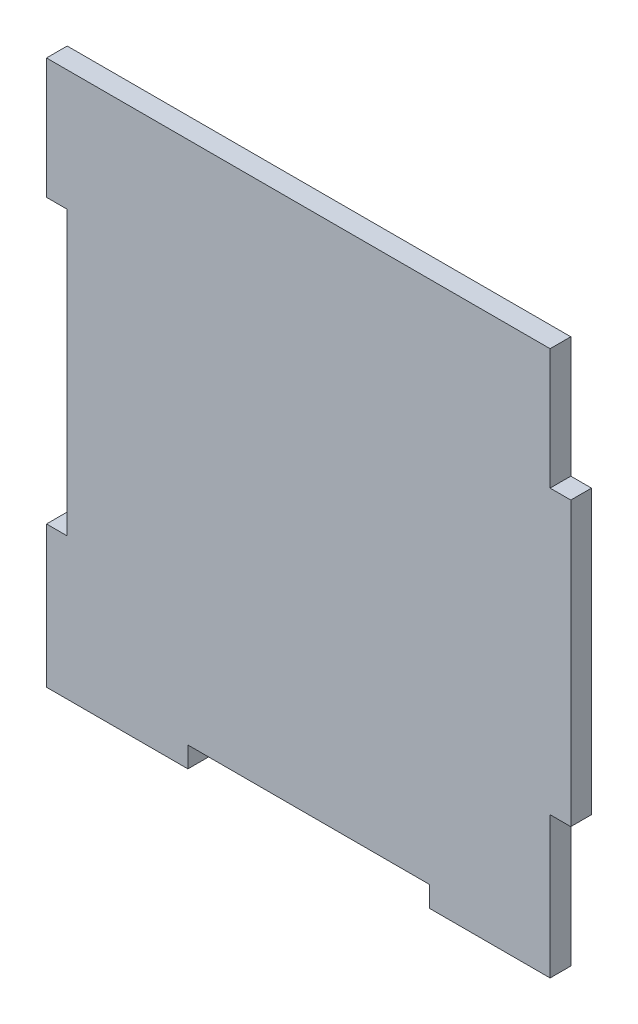
ISO-10303-21;
HEADER;
FILE_DESCRIPTION(('STEP AP214'),'2;1');
FILE_NAME('part.step','',(''),(''),'','','');
FILE_SCHEMA(('AUTOMOTIVE_DESIGN { 1 0 10303 214 1 1 1 1 }'));
ENDSEC;
DATA;
#1=APPLICATION_CONTEXT('core data for automotive mechanical design processes');
#2=APPLICATION_PROTOCOL_DEFINITION('international standard','automotive_design',2000,#1);
#3=PRODUCT_CONTEXT('',#1,'mechanical');
#4=PRODUCT('Part','Part','',(#3));
#5=PRODUCT_RELATED_PRODUCT_CATEGORY('part','',(#4));
#6=PRODUCT_DEFINITION_FORMATION('','',#4);
#7=PRODUCT_DEFINITION_CONTEXT('part definition',#1,'design');
#8=PRODUCT_DEFINITION('design','',#6,#7);
#9=PRODUCT_DEFINITION_SHAPE('','',#8);
#10=(LENGTH_UNIT() NAMED_UNIT(*) SI_UNIT(.MILLI.,.METRE.));
#11=(NAMED_UNIT(*) PLANE_ANGLE_UNIT() SI_UNIT($,.RADIAN.));
#12=(NAMED_UNIT(*) SI_UNIT($,.STERADIAN.) SOLID_ANGLE_UNIT());
#13=UNCERTAINTY_MEASURE_WITH_UNIT(LENGTH_MEASURE(1.E-05),#10,'distance_accuracy_value','');
#14=(GEOMETRIC_REPRESENTATION_CONTEXT(3) GLOBAL_UNCERTAINTY_ASSIGNED_CONTEXT((#13)) GLOBAL_UNIT_ASSIGNED_CONTEXT((#10,
#11,#12)) REPRESENTATION_CONTEXT('',''));
#15=CARTESIAN_POINT('',(0.,0.,0.));
#16=DIRECTION('',(0.,0.,1.));
#17=DIRECTION('',(1.,0.,0.));
#18=AXIS2_PLACEMENT_3D('',#15,#16,#17);
#19=CARTESIAN_POINT('',(35.,-20.5,3.));
#20=DIRECTION('',(0.,1.,0.));
#21=DIRECTION('',(-1.,0.,0.));
#22=AXIS2_PLACEMENT_3D('',#19,#20,#21);
#23=PLANE('',#22);
#24=DIRECTION('',(1.,0.,0.));
#25=VECTOR('',#24,1.);
#26=CARTESIAN_POINT('',(35.,-20.5,0.));
#27=LINE('',#26,#25);
#28=CARTESIAN_POINT('',(35.,-20.5,0.));
#29=VERTEX_POINT('',#28);
#30=CARTESIAN_POINT('',(38.,-20.5,0.));
#31=VERTEX_POINT('',#30);
#32=EDGE_CURVE('E185',#29,#31,#27,.T.);
#33=ORIENTED_EDGE('',*,*,#32,.T.);
#34=DIRECTION('',(0.,0.,-1.));
#35=VECTOR('',#34,1.);
#36=CARTESIAN_POINT('',(38.,-20.5,3.));
#37=LINE('',#36,#35);
#38=CARTESIAN_POINT('',(38.,-20.5,3.));
#39=VERTEX_POINT('',#38);
#40=EDGE_CURVE('E45',#39,#31,#37,.T.);
#41=ORIENTED_EDGE('',*,*,#40,.F.);
#42=DIRECTION('',(1.,0.,0.));
#43=VECTOR('',#42,1.);
#44=CARTESIAN_POINT('',(35.,-20.5,3.));
#45=LINE('',#44,#43);
#46=CARTESIAN_POINT('',(35.,-20.5,3.));
#47=VERTEX_POINT('',#46);
#48=EDGE_CURVE('E121',#47,#39,#45,.T.);
#49=ORIENTED_EDGE('',*,*,#48,.F.);
#50=DIRECTION('',(0.,0.,-1.));
#51=VECTOR('',#50,1.);
#52=CARTESIAN_POINT('',(35.,-20.5,3.));
#53=LINE('',#52,#51);
#54=EDGE_CURVE('E11',#47,#29,#53,.T.);
#55=ORIENTED_EDGE('',*,*,#54,.T.);
#56=EDGE_LOOP('',(#33,#41,#49,#55));
#57=FACE_BOUND('',#56,.T.);
#58=ADVANCED_FACE('F37',(#57),#23,.F.);
#59=CARTESIAN_POINT('',(38.,20.5,3.));
#60=DIRECTION('',(-1.,0.,0.));
#61=DIRECTION('',(0.,0.,1.));
#62=AXIS2_PLACEMENT_3D('',#59,#60,#61);
#63=PLANE('',#62);
#64=DIRECTION('',(0.,1.,0.));
#65=VECTOR('',#64,1.);
#66=CARTESIAN_POINT('',(38.,20.5,0.));
#67=LINE('',#66,#65);
#68=CARTESIAN_POINT('',(38.,20.5,0.));
#69=VERTEX_POINT('',#68);
#70=EDGE_CURVE('E187',#31,#69,#67,.T.);
#71=ORIENTED_EDGE('',*,*,#70,.T.);
#72=DIRECTION('',(0.,0.,-1.));
#73=VECTOR('',#72,1.);
#74=CARTESIAN_POINT('',(38.,20.5,3.));
#75=LINE('',#74,#73);
#76=CARTESIAN_POINT('',(38.,20.5,3.));
#77=VERTEX_POINT('',#76);
#78=EDGE_CURVE('E247',#77,#69,#75,.T.);
#79=ORIENTED_EDGE('',*,*,#78,.F.);
#80=DIRECTION('',(0.,1.,0.));
#81=VECTOR('',#80,1.);
#82=CARTESIAN_POINT('',(38.,20.5,3.));
#83=LINE('',#82,#81);
#84=EDGE_CURVE('E255',#39,#77,#83,.T.);
#85=ORIENTED_EDGE('',*,*,#84,.F.);
#86=ORIENTED_EDGE('',*,*,#40,.T.);
#87=EDGE_LOOP('',(#71,#79,#85,#86));
#88=FACE_BOUND('',#87,.T.);
#89=ADVANCED_FACE('F253',(#88),#63,.F.);
#90=CARTESIAN_POINT('',(35.,20.5,3.));
#91=DIRECTION('',(0.,-1.,0.));
#92=DIRECTION('',(1.,0.,0.));
#93=AXIS2_PLACEMENT_3D('',#90,#91,#92);
#94=PLANE('',#93);
#95=DIRECTION('',(-1.,0.,0.));
#96=VECTOR('',#95,1.);
#97=CARTESIAN_POINT('',(35.,20.5,0.));
#98=LINE('',#97,#96);
#99=CARTESIAN_POINT('',(35.,20.5,0.));
#100=VERTEX_POINT('',#99);
#101=EDGE_CURVE('E189',#69,#100,#98,.T.);
#102=ORIENTED_EDGE('',*,*,#101,.T.);
#103=DIRECTION('',(0.,0.,-1.));
#104=VECTOR('',#103,1.);
#105=CARTESIAN_POINT('',(35.,20.5,3.));
#106=LINE('',#105,#104);
#107=CARTESIAN_POINT('',(35.,20.5,3.));
#108=VERTEX_POINT('',#107);
#109=EDGE_CURVE('E244',#108,#100,#106,.T.);
#110=ORIENTED_EDGE('',*,*,#109,.F.);
#111=DIRECTION('',(-1.,0.,0.));
#112=VECTOR('',#111,1.);
#113=CARTESIAN_POINT('',(35.,20.5,3.));
#114=LINE('',#113,#112);
#115=EDGE_CURVE('E273',#77,#108,#114,.T.);
#116=ORIENTED_EDGE('',*,*,#115,.F.);
#117=ORIENTED_EDGE('',*,*,#78,.T.);
#118=EDGE_LOOP('',(#102,#110,#116,#117));
#119=FACE_BOUND('',#118,.T.);
#120=ADVANCED_FACE('F264',(#119),#94,.F.);
#121=CARTESIAN_POINT('',(35.,38.,3.));
#122=DIRECTION('',(-1.,0.,0.));
#123=DIRECTION('',(0.,-1.,0.));
#124=AXIS2_PLACEMENT_3D('',#121,#122,#123);
#125=PLANE('',#124);
#126=DIRECTION('',(0.,1.,0.));
#127=VECTOR('',#126,1.);
#128=CARTESIAN_POINT('',(35.,38.,0.));
#129=LINE('',#128,#127);
#130=CARTESIAN_POINT('',(35.,38.,0.));
#131=VERTEX_POINT('',#130);
#132=EDGE_CURVE('E191',#100,#131,#129,.T.);
#133=ORIENTED_EDGE('',*,*,#132,.T.);
#134=DIRECTION('',(0.,0.,-1.));
#135=VECTOR('',#134,1.);
#136=CARTESIAN_POINT('',(35.,38.,3.));
#137=LINE('',#136,#135);
#138=CARTESIAN_POINT('',(35.,38.,3.));
#139=VERTEX_POINT('',#138);
#140=EDGE_CURVE('E241',#139,#131,#137,.T.);
#141=ORIENTED_EDGE('',*,*,#140,.F.);
#142=DIRECTION('',(0.,1.,0.));
#143=VECTOR('',#142,1.);
#144=CARTESIAN_POINT('',(35.,38.,3.));
#145=LINE('',#144,#143);
#146=EDGE_CURVE('E270',#108,#139,#145,.T.);
#147=ORIENTED_EDGE('',*,*,#146,.F.);
#148=ORIENTED_EDGE('',*,*,#109,.T.);
#149=EDGE_LOOP('',(#133,#141,#147,#148));
#150=FACE_BOUND('',#149,.T.);
#151=ADVANCED_FACE('F268',(#150),#125,.F.);
#152=CARTESIAN_POINT('',(-38.,38.,3.));
#153=DIRECTION('',(0.,-1.,0.));
#154=DIRECTION('',(0.,0.,-1.));
#155=AXIS2_PLACEMENT_3D('',#152,#153,#154);
#156=PLANE('',#155);
#157=DIRECTION('',(-1.,0.,0.));
#158=VECTOR('',#157,1.);
#159=CARTESIAN_POINT('',(-38.,38.,0.));
#160=LINE('',#159,#158);
#161=CARTESIAN_POINT('',(-38.,38.,0.));
#162=VERTEX_POINT('',#161);
#163=EDGE_CURVE('E194',#131,#162,#160,.T.);
#164=ORIENTED_EDGE('',*,*,#163,.T.);
#165=DIRECTION('',(0.,0.,-1.));
#166=VECTOR('',#165,1.);
#167=CARTESIAN_POINT('',(-38.,38.,3.));
#168=LINE('',#167,#166);
#169=CARTESIAN_POINT('',(-38.,38.,3.));
#170=VERTEX_POINT('',#169);
#171=EDGE_CURVE('E238',#170,#162,#168,.T.);
#172=ORIENTED_EDGE('',*,*,#171,.F.);
#173=DIRECTION('',(-1.,0.,0.));
#174=VECTOR('',#173,1.);
#175=CARTESIAN_POINT('',(17.5,38.,3.));
#176=LINE('',#175,#174);
#177=EDGE_CURVE('E272',#139,#170,#176,.T.);
#178=ORIENTED_EDGE('',*,*,#177,.F.);
#179=ORIENTED_EDGE('',*,*,#140,.T.);
#180=EDGE_LOOP('',(#164,#172,#178,#179));
#181=FACE_BOUND('',#180,.T.);
#182=ADVANCED_FACE('F322',(#181),#156,.F.);
#183=CARTESIAN_POINT('',(-38.,20.5,3.));
#184=DIRECTION('',(1.,0.,0.));
#185=DIRECTION('',(0.,0.,-1.));
#186=AXIS2_PLACEMENT_3D('',#183,#184,#185);
#187=PLANE('',#186);
#188=DIRECTION('',(0.,-1.,0.));
#189=VECTOR('',#188,1.);
#190=CARTESIAN_POINT('',(-38.,20.5,0.));
#191=LINE('',#190,#189);
#192=CARTESIAN_POINT('',(-38.,20.5,0.));
#193=VERTEX_POINT('',#192);
#194=EDGE_CURVE('E196',#162,#193,#191,.T.);
#195=ORIENTED_EDGE('',*,*,#194,.T.);
#196=DIRECTION('',(0.,0.,-1.));
#197=VECTOR('',#196,1.);
#198=CARTESIAN_POINT('',(-38.,20.5,3.));
#199=LINE('',#198,#197);
#200=CARTESIAN_POINT('',(-38.,20.5,3.));
#201=VERTEX_POINT('',#200);
#202=EDGE_CURVE('E235',#201,#193,#199,.T.);
#203=ORIENTED_EDGE('',*,*,#202,.F.);
#204=DIRECTION('',(0.,-1.,0.));
#205=VECTOR('',#204,1.);
#206=CARTESIAN_POINT('',(-38.,20.5,3.));
#207=LINE('',#206,#205);
#208=EDGE_CURVE('E275',#170,#201,#207,.T.);
#209=ORIENTED_EDGE('',*,*,#208,.F.);
#210=ORIENTED_EDGE('',*,*,#171,.T.);
#211=EDGE_LOOP('',(#195,#203,#209,#210));
#212=FACE_BOUND('',#211,.T.);
#213=ADVANCED_FACE('F325',(#212),#187,.F.);
#214=CARTESIAN_POINT('',(-35.,20.5,3.));
#215=DIRECTION('',(0.,1.,0.));
#216=DIRECTION('',(0.,0.,1.));
#217=AXIS2_PLACEMENT_3D('',#214,#215,#216);
#218=PLANE('',#217);
#219=DIRECTION('',(1.,0.,0.));
#220=VECTOR('',#219,1.);
#221=CARTESIAN_POINT('',(-35.,20.5,0.));
#222=LINE('',#221,#220);
#223=CARTESIAN_POINT('',(-35.,20.5,0.));
#224=VERTEX_POINT('',#223);
#225=EDGE_CURVE('E198',#193,#224,#222,.T.);
#226=ORIENTED_EDGE('',*,*,#225,.T.);
#227=DIRECTION('',(0.,0.,-1.));
#228=VECTOR('',#227,1.);
#229=CARTESIAN_POINT('',(-35.,20.5,3.));
#230=LINE('',#229,#228);
#231=CARTESIAN_POINT('',(-35.,20.5,3.));
#232=VERTEX_POINT('',#231);
#233=EDGE_CURVE('E232',#232,#224,#230,.T.);
#234=ORIENTED_EDGE('',*,*,#233,.F.);
#235=DIRECTION('',(1.,0.,0.));
#236=VECTOR('',#235,1.);
#237=CARTESIAN_POINT('',(-35.,20.5,3.));
#238=LINE('',#237,#236);
#239=EDGE_CURVE('E281',#201,#232,#238,.T.);
#240=ORIENTED_EDGE('',*,*,#239,.F.);
#241=ORIENTED_EDGE('',*,*,#202,.T.);
#242=EDGE_LOOP('',(#226,#234,#240,#241));
#243=FACE_BOUND('',#242,.T.);
#244=ADVANCED_FACE('F329',(#243),#218,.F.);
#245=CARTESIAN_POINT('',(-35.,20.5,3.));
#246=DIRECTION('',(1.,0.,0.));
#247=DIRECTION('',(0.,0.,-1.));
#248=AXIS2_PLACEMENT_3D('',#245,#246,#247);
#249=PLANE('',#248);
#250=DIRECTION('',(0.,-1.,0.));
#251=VECTOR('',#250,1.);
#252=CARTESIAN_POINT('',(-35.,20.5,0.));
#253=LINE('',#252,#251);
#254=CARTESIAN_POINT('',(-35.,-20.5,0.));
#255=VERTEX_POINT('',#254);
#256=EDGE_CURVE('E200',#224,#255,#253,.T.);
#257=ORIENTED_EDGE('',*,*,#256,.T.);
#258=DIRECTION('',(0.,0.,-1.));
#259=VECTOR('',#258,1.);
#260=CARTESIAN_POINT('',(-35.,-20.5,3.));
#261=LINE('',#260,#259);
#262=CARTESIAN_POINT('',(-35.,-20.5,3.));
#263=VERTEX_POINT('',#262);
#264=EDGE_CURVE('E229',#263,#255,#261,.T.);
#265=ORIENTED_EDGE('',*,*,#264,.F.);
#266=DIRECTION('',(0.,-1.,0.));
#267=VECTOR('',#266,1.);
#268=CARTESIAN_POINT('',(-35.,20.5,3.));
#269=LINE('',#268,#267);
#270=EDGE_CURVE('E283',#232,#263,#269,.T.);
#271=ORIENTED_EDGE('',*,*,#270,.F.);
#272=ORIENTED_EDGE('',*,*,#233,.T.);
#273=EDGE_LOOP('',(#257,#265,#271,#272));
#274=FACE_BOUND('',#273,.T.);
#275=ADVANCED_FACE('F333',(#274),#249,.F.);
#276=CARTESIAN_POINT('',(-35.,-20.5,3.));
#277=DIRECTION('',(0.,-1.,0.));
#278=DIRECTION('',(0.,0.,-1.));
#279=AXIS2_PLACEMENT_3D('',#276,#277,#278);
#280=PLANE('',#279);
#281=DIRECTION('',(-1.,0.,0.));
#282=VECTOR('',#281,1.);
#283=CARTESIAN_POINT('',(-35.,-20.5,0.));
#284=LINE('',#283,#282);
#285=CARTESIAN_POINT('',(-38.,-20.5,0.));
#286=VERTEX_POINT('',#285);
#287=EDGE_CURVE('E202',#255,#286,#284,.T.);
#288=ORIENTED_EDGE('',*,*,#287,.T.);
#289=DIRECTION('',(0.,0.,-1.));
#290=VECTOR('',#289,1.);
#291=CARTESIAN_POINT('',(-38.,-20.5,3.));
#292=LINE('',#291,#290);
#293=CARTESIAN_POINT('',(-38.,-20.5,3.));
#294=VERTEX_POINT('',#293);
#295=EDGE_CURVE('E226',#294,#286,#292,.T.);
#296=ORIENTED_EDGE('',*,*,#295,.F.);
#297=DIRECTION('',(-1.,0.,0.));
#298=VECTOR('',#297,1.);
#299=CARTESIAN_POINT('',(-35.,-20.5,3.));
#300=LINE('',#299,#298);
#301=EDGE_CURVE('E285',#263,#294,#300,.T.);
#302=ORIENTED_EDGE('',*,*,#301,.F.);
#303=ORIENTED_EDGE('',*,*,#264,.T.);
#304=EDGE_LOOP('',(#288,#296,#302,#303));
#305=FACE_BOUND('',#304,.T.);
#306=ADVANCED_FACE('F337',(#305),#280,.F.);
#307=CARTESIAN_POINT('',(-38.,-38.,3.));
#308=DIRECTION('',(1.,0.,0.));
#309=DIRECTION('',(0.,0.,-1.));
#310=AXIS2_PLACEMENT_3D('',#307,#308,#309);
#311=PLANE('',#310);
#312=DIRECTION('',(0.,-1.,0.));
#313=VECTOR('',#312,1.);
#314=CARTESIAN_POINT('',(-38.,-38.,0.));
#315=LINE('',#314,#313);
#316=CARTESIAN_POINT('',(-38.,-41.,0.));
#317=VERTEX_POINT('',#316);
#318=EDGE_CURVE('E205',#286,#317,#315,.T.);
#319=ORIENTED_EDGE('',*,*,#318,.T.);
#320=DIRECTION('',(0.,0.,-1.));
#321=VECTOR('',#320,1.);
#322=CARTESIAN_POINT('',(-38.,-41.,3.));
#323=LINE('',#322,#321);
#324=CARTESIAN_POINT('',(-38.,-41.,3.));
#325=VERTEX_POINT('',#324);
#326=EDGE_CURVE('E223',#325,#317,#323,.T.);
#327=ORIENTED_EDGE('',*,*,#326,.F.);
#328=DIRECTION('',(0.,-1.,0.));
#329=VECTOR('',#328,1.);
#330=CARTESIAN_POINT('',(-38.,-20.5,3.));
#331=LINE('',#330,#329);
#332=EDGE_CURVE('E287',#294,#325,#331,.T.);
#333=ORIENTED_EDGE('',*,*,#332,.F.);
#334=ORIENTED_EDGE('',*,*,#295,.T.);
#335=EDGE_LOOP('',(#319,#327,#333,#334));
#336=FACE_BOUND('',#335,.T.);
#337=ADVANCED_FACE('F341',(#336),#311,.F.);
#338=CARTESIAN_POINT('',(-35.,-41.,3.));
#339=DIRECTION('',(0.,1.,0.));
#340=DIRECTION('',(0.,0.,1.));
#341=AXIS2_PLACEMENT_3D('',#338,#339,#340);
#342=PLANE('',#341);
#343=DIRECTION('',(1.,0.,0.));
#344=VECTOR('',#343,1.);
#345=CARTESIAN_POINT('',(-35.,-41.,0.));
#346=LINE('',#345,#344);
#347=CARTESIAN_POINT('',(-17.5,-41.,0.));
#348=VERTEX_POINT('',#347);
#349=EDGE_CURVE('E208',#317,#348,#346,.T.);
#350=ORIENTED_EDGE('',*,*,#349,.T.);
#351=DIRECTION('',(0.,0.,-1.));
#352=VECTOR('',#351,1.);
#353=CARTESIAN_POINT('',(-17.5,-41.,3.));
#354=LINE('',#353,#352);
#355=CARTESIAN_POINT('',(-17.5,-41.,3.));
#356=VERTEX_POINT('',#355);
#357=EDGE_CURVE('E220',#356,#348,#354,.T.);
#358=ORIENTED_EDGE('',*,*,#357,.F.);
#359=DIRECTION('',(1.,0.,0.));
#360=VECTOR('',#359,1.);
#361=CARTESIAN_POINT('',(-38.,-41.,3.));
#362=LINE('',#361,#360);
#363=EDGE_CURVE('E289',#325,#356,#362,.T.);
#364=ORIENTED_EDGE('',*,*,#363,.F.);
#365=ORIENTED_EDGE('',*,*,#326,.T.);
#366=EDGE_LOOP('',(#350,#358,#364,#365));
#367=FACE_BOUND('',#366,.T.);
#368=ADVANCED_FACE('F295',(#367),#342,.F.);
#369=CARTESIAN_POINT('',(-17.5,-38.,3.));
#370=DIRECTION('',(-1.,0.,0.));
#371=DIRECTION('',(0.,0.,1.));
#372=AXIS2_PLACEMENT_3D('',#369,#370,#371);
#373=PLANE('',#372);
#374=DIRECTION('',(0.,1.,0.));
#375=VECTOR('',#374,1.);
#376=CARTESIAN_POINT('',(-17.5,-38.,0.));
#377=LINE('',#376,#375);
#378=CARTESIAN_POINT('',(-17.5,-38.,0.));
#379=VERTEX_POINT('',#378);
#380=EDGE_CURVE('E210',#348,#379,#377,.T.);
#381=ORIENTED_EDGE('',*,*,#380,.T.);
#382=DIRECTION('',(0.,0.,-1.));
#383=VECTOR('',#382,1.);
#384=CARTESIAN_POINT('',(-17.5,-38.,3.));
#385=LINE('',#384,#383);
#386=CARTESIAN_POINT('',(-17.5,-38.,3.));
#387=VERTEX_POINT('',#386);
#388=EDGE_CURVE('E174',#387,#379,#385,.T.);
#389=ORIENTED_EDGE('',*,*,#388,.F.);
#390=DIRECTION('',(0.,1.,0.));
#391=VECTOR('',#390,1.);
#392=CARTESIAN_POINT('',(-17.5,-38.,3.));
#393=LINE('',#392,#391);
#394=EDGE_CURVE('E165',#356,#387,#393,.T.);
#395=ORIENTED_EDGE('',*,*,#394,.F.);
#396=ORIENTED_EDGE('',*,*,#357,.T.);
#397=EDGE_LOOP('',(#381,#389,#395,#396));
#398=FACE_BOUND('',#397,.T.);
#399=ADVANCED_FACE('F298',(#398),#373,.F.);
#400=CARTESIAN_POINT('',(-17.5,-38.,3.));
#401=DIRECTION('',(0.,1.,0.));
#402=DIRECTION('',(-1.,0.,0.));
#403=AXIS2_PLACEMENT_3D('',#400,#401,#402);
#404=PLANE('',#403);
#405=DIRECTION('',(1.,0.,0.));
#406=VECTOR('',#405,1.);
#407=CARTESIAN_POINT('',(-17.5,-38.,0.));
#408=LINE('',#407,#406);
#409=CARTESIAN_POINT('',(17.5,-38.,0.));
#410=VERTEX_POINT('',#409);
#411=EDGE_CURVE('E173',#379,#410,#408,.T.);
#412=ORIENTED_EDGE('',*,*,#411,.T.);
#413=DIRECTION('',(0.,0.,-1.));
#414=VECTOR('',#413,1.);
#415=CARTESIAN_POINT('',(17.5,-38.,3.));
#416=LINE('',#415,#414);
#417=CARTESIAN_POINT('',(17.5,-38.,3.));
#418=VERTEX_POINT('',#417);
#419=EDGE_CURVE('E170',#418,#410,#416,.T.);
#420=ORIENTED_EDGE('',*,*,#419,.F.);
#421=DIRECTION('',(1.,0.,0.));
#422=VECTOR('',#421,1.);
#423=CARTESIAN_POINT('',(-17.5,-38.,3.));
#424=LINE('',#423,#422);
#425=EDGE_CURVE('E159',#387,#418,#424,.T.);
#426=ORIENTED_EDGE('',*,*,#425,.F.);
#427=ORIENTED_EDGE('',*,*,#388,.T.);
#428=EDGE_LOOP('',(#412,#420,#426,#427));
#429=FACE_BOUND('',#428,.T.);
#430=ADVANCED_FACE('F171',(#429),#404,.F.);
#431=CARTESIAN_POINT('',(17.5,-41.,3.));
#432=DIRECTION('',(1.,0.,0.));
#433=DIRECTION('',(0.,1.,0.));
#434=AXIS2_PLACEMENT_3D('',#431,#432,#433);
#435=PLANE('',#434);
#436=DIRECTION('',(0.,-1.,0.));
#437=VECTOR('',#436,1.);
#438=CARTESIAN_POINT('',(17.5,-41.,0.));
#439=LINE('',#438,#437);
#440=CARTESIAN_POINT('',(17.5,-41.,0.));
#441=VERTEX_POINT('',#440);
#442=EDGE_CURVE('E107',#410,#441,#439,.T.);
#443=ORIENTED_EDGE('',*,*,#442,.T.);
#444=DIRECTION('',(0.,0.,-1.));
#445=VECTOR('',#444,1.);
#446=CARTESIAN_POINT('',(17.5,-41.,3.));
#447=LINE('',#446,#445);
#448=CARTESIAN_POINT('',(17.5,-41.,3.));
#449=VERTEX_POINT('',#448);
#450=EDGE_CURVE('E175',#449,#441,#447,.T.);
#451=ORIENTED_EDGE('',*,*,#450,.F.);
#452=DIRECTION('',(0.,-1.,0.));
#453=VECTOR('',#452,1.);
#454=CARTESIAN_POINT('',(17.5,-41.,3.));
#455=LINE('',#454,#453);
#456=EDGE_CURVE('E163',#418,#449,#455,.T.);
#457=ORIENTED_EDGE('',*,*,#456,.F.);
#458=ORIENTED_EDGE('',*,*,#419,.T.);
#459=EDGE_LOOP('',(#443,#451,#457,#458));
#460=FACE_BOUND('',#459,.T.);
#461=ADVANCED_FACE('F177',(#460),#435,.F.);
#462=CARTESIAN_POINT('',(35.,-41.,3.));
#463=DIRECTION('',(0.,1.,0.));
#464=DIRECTION('',(-1.,0.,0.));
#465=AXIS2_PLACEMENT_3D('',#462,#463,#464);
#466=PLANE('',#465);
#467=DIRECTION('',(1.,0.,0.));
#468=VECTOR('',#467,1.);
#469=CARTESIAN_POINT('',(35.,-41.,0.));
#470=LINE('',#469,#468);
#471=CARTESIAN_POINT('',(35.,-41.,0.));
#472=VERTEX_POINT('',#471);
#473=EDGE_CURVE('E114',#441,#472,#470,.T.);
#474=ORIENTED_EDGE('',*,*,#473,.T.);
#475=DIRECTION('',(0.,0.,-1.));
#476=VECTOR('',#475,1.);
#477=CARTESIAN_POINT('',(35.,-41.,3.));
#478=LINE('',#477,#476);
#479=CARTESIAN_POINT('',(35.,-41.,3.));
#480=VERTEX_POINT('',#479);
#481=EDGE_CURVE('E181',#480,#472,#478,.T.);
#482=ORIENTED_EDGE('',*,*,#481,.F.);
#483=DIRECTION('',(1.,0.,0.));
#484=VECTOR('',#483,1.);
#485=CARTESIAN_POINT('',(35.,-41.,3.));
#486=LINE('',#485,#484);
#487=EDGE_CURVE('E179',#449,#480,#486,.T.);
#488=ORIENTED_EDGE('',*,*,#487,.F.);
#489=ORIENTED_EDGE('',*,*,#450,.T.);
#490=EDGE_LOOP('',(#474,#482,#488,#489));
#491=FACE_BOUND('',#490,.T.);
#492=ADVANCED_FACE('F300',(#491),#466,.F.);
#493=CARTESIAN_POINT('',(35.,-38.,3.));
#494=DIRECTION('',(-1.,0.,0.));
#495=DIRECTION('',(0.,-1.,0.));
#496=AXIS2_PLACEMENT_3D('',#493,#494,#495);
#497=PLANE('',#496);
#498=DIRECTION('',(0.,1.,0.));
#499=VECTOR('',#498,1.);
#500=CARTESIAN_POINT('',(35.,-38.,0.));
#501=LINE('',#500,#499);
#502=EDGE_CURVE('E215',#472,#29,#501,.T.);
#503=ORIENTED_EDGE('',*,*,#502,.T.);
#504=ORIENTED_EDGE('',*,*,#54,.F.);
#505=DIRECTION('',(0.,1.,0.));
#506=VECTOR('',#505,1.);
#507=CARTESIAN_POINT('',(35.,-20.5,3.));
#508=LINE('',#507,#506);
#509=EDGE_CURVE('E53',#480,#47,#508,.T.);
#510=ORIENTED_EDGE('',*,*,#509,.F.);
#511=ORIENTED_EDGE('',*,*,#481,.T.);
#512=EDGE_LOOP('',(#503,#504,#510,#511));
#513=FACE_BOUND('',#512,.T.);
#514=ADVANCED_FACE('F299',(#513),#497,.F.);
#515=CARTESIAN_POINT('',(0.,0.,3.));
#516=DIRECTION('',(0.,0.,-1.));
#517=DIRECTION('',(-1.,0.,0.));
#518=AXIS2_PLACEMENT_3D('',#515,#516,#517);
#519=PLANE('',#518);
#520=ORIENTED_EDGE('',*,*,#509,.T.);
#521=ORIENTED_EDGE('',*,*,#48,.T.);
#522=ORIENTED_EDGE('',*,*,#84,.T.);
#523=ORIENTED_EDGE('',*,*,#115,.T.);
#524=ORIENTED_EDGE('',*,*,#146,.T.);
#525=ORIENTED_EDGE('',*,*,#177,.T.);
#526=ORIENTED_EDGE('',*,*,#208,.T.);
#527=ORIENTED_EDGE('',*,*,#239,.T.);
#528=ORIENTED_EDGE('',*,*,#270,.T.);
#529=ORIENTED_EDGE('',*,*,#301,.T.);
#530=ORIENTED_EDGE('',*,*,#332,.T.);
#531=ORIENTED_EDGE('',*,*,#363,.T.);
#532=ORIENTED_EDGE('',*,*,#394,.T.);
#533=ORIENTED_EDGE('',*,*,#425,.T.);
#534=ORIENTED_EDGE('',*,*,#456,.T.);
#535=ORIENTED_EDGE('',*,*,#487,.T.);
#536=EDGE_LOOP('',(#520,#521,#522,#523,#524,#525,#526,#527,#528,#529,#530,#531,#532,#533,#534,#535));
#537=FACE_BOUND('',#536,.T.);
#538=ADVANCED_FACE('F161',(#537),#519,.F.);
#539=CARTESIAN_POINT('',(0.,0.,0.));
#540=DIRECTION('',(0.,0.,-1.));
#541=DIRECTION('',(-1.,0.,0.));
#542=AXIS2_PLACEMENT_3D('',#539,#540,#541);
#543=PLANE('',#542);
#544=ORIENTED_EDGE('',*,*,#32,.F.);
#545=ORIENTED_EDGE('',*,*,#502,.F.);
#546=ORIENTED_EDGE('',*,*,#473,.F.);
#547=ORIENTED_EDGE('',*,*,#442,.F.);
#548=ORIENTED_EDGE('',*,*,#411,.F.);
#549=ORIENTED_EDGE('',*,*,#380,.F.);
#550=ORIENTED_EDGE('',*,*,#349,.F.);
#551=ORIENTED_EDGE('',*,*,#318,.F.);
#552=ORIENTED_EDGE('',*,*,#287,.F.);
#553=ORIENTED_EDGE('',*,*,#256,.F.);
#554=ORIENTED_EDGE('',*,*,#225,.F.);
#555=ORIENTED_EDGE('',*,*,#194,.F.);
#556=ORIENTED_EDGE('',*,*,#163,.F.);
#557=ORIENTED_EDGE('',*,*,#132,.F.);
#558=ORIENTED_EDGE('',*,*,#101,.F.);
#559=ORIENTED_EDGE('',*,*,#70,.F.);
#560=EDGE_LOOP('',(#544,#545,#546,#547,#548,#549,#550,#551,#552,#553,#554,#555,#556,#557,#558,#559));
#561=FACE_BOUND('',#560,.T.);
#562=ADVANCED_FACE('F259',(#561),#543,.T.);
#563=CLOSED_SHELL('',(#58,#89,#120,#151,#182,#213,#244,#275,#306,#337,#368,#399,#430,#461,#492,
#514,#538,#562));
#564=MANIFOLD_SOLID_BREP('B2',#563);
#565=ADVANCED_BREP_SHAPE_REPRESENTATION('',(#18,#564),#14);
#566=SHAPE_DEFINITION_REPRESENTATION(#9,#565);
ENDSEC;
END-ISO-10303-21;
